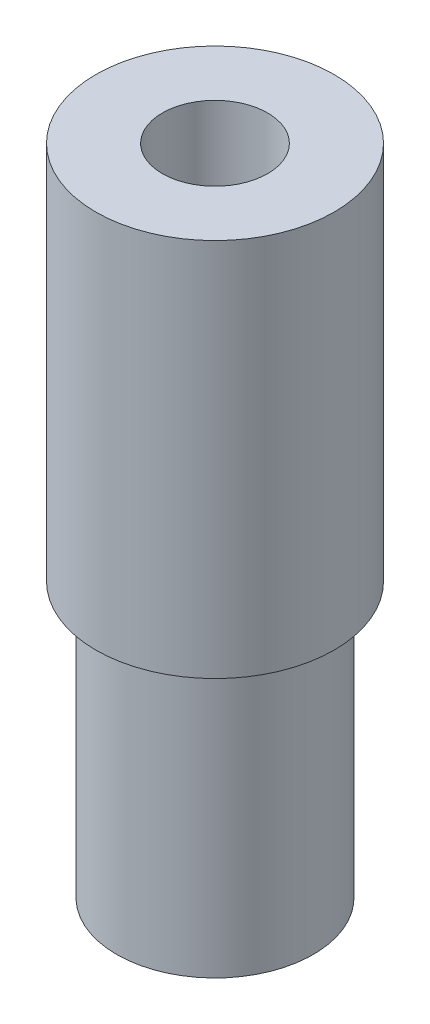
ISO-10303-21;
HEADER;
FILE_DESCRIPTION(('STEP AP214'),'2;1');
FILE_NAME('part.step','',(''),(''),'','','');
FILE_SCHEMA(('AUTOMOTIVE_DESIGN { 1 0 10303 214 1 1 1 1 }'));
ENDSEC;
DATA;
#1=APPLICATION_CONTEXT('core data for automotive mechanical design processes');
#2=APPLICATION_PROTOCOL_DEFINITION('international standard','automotive_design',2000,#1);
#3=PRODUCT_CONTEXT('',#1,'mechanical');
#4=PRODUCT('Part','Part','',(#3));
#5=PRODUCT_RELATED_PRODUCT_CATEGORY('part','',(#4));
#6=PRODUCT_DEFINITION_FORMATION('','',#4);
#7=PRODUCT_DEFINITION_CONTEXT('part definition',#1,'design');
#8=PRODUCT_DEFINITION('design','',#6,#7);
#9=PRODUCT_DEFINITION_SHAPE('','',#8);
#10=(LENGTH_UNIT() NAMED_UNIT(*) SI_UNIT(.MILLI.,.METRE.));
#11=(NAMED_UNIT(*) PLANE_ANGLE_UNIT() SI_UNIT($,.RADIAN.));
#12=(NAMED_UNIT(*) SI_UNIT($,.STERADIAN.) SOLID_ANGLE_UNIT());
#13=UNCERTAINTY_MEASURE_WITH_UNIT(LENGTH_MEASURE(1.E-05),#10,'distance_accuracy_value','');
#14=(GEOMETRIC_REPRESENTATION_CONTEXT(3) GLOBAL_UNCERTAINTY_ASSIGNED_CONTEXT((#13)) GLOBAL_UNIT_ASSIGNED_CONTEXT((#10,
#11,#12)) REPRESENTATION_CONTEXT('',''));
#15=CARTESIAN_POINT('',(0.,0.,0.));
#16=DIRECTION('',(0.,0.,1.));
#17=DIRECTION('',(1.,0.,0.));
#18=AXIS2_PLACEMENT_3D('',#15,#16,#17);
#19=CARTESIAN_POINT('',(0.,13.8,0.));
#20=DIRECTION('',(0.,-1.,0.));
#21=DIRECTION('',(0.,0.,-1.));
#22=AXIS2_PLACEMENT_3D('',#19,#20,#21);
#23=CYLINDRICAL_SURFACE('',#22,4.95);
#24=CARTESIAN_POINT('',(0.,13.8,0.));
#25=DIRECTION('',(0.,1.,0.));
#26=DIRECTION('',(0.,0.,1.));
#27=AXIS2_PLACEMENT_3D('',#24,#25,#26);
#28=CIRCLE('',#27,4.95);
#29=CARTESIAN_POINT('',(0.,13.8,4.95));
#30=VERTEX_POINT('',#29);
#31=EDGE_CURVE('E44',#30,#30,#28,.T.);
#32=ORIENTED_EDGE('',*,*,#31,.F.);
#33=EDGE_LOOP('',(#32));
#34=FACE_BOUND('',#33,.T.);
#35=CARTESIAN_POINT('',(0.,0.,0.));
#36=DIRECTION('',(0.,1.,0.));
#37=DIRECTION('',(0.,0.,1.));
#38=AXIS2_PLACEMENT_3D('',#35,#36,#37);
#39=CIRCLE('',#38,4.95);
#40=CARTESIAN_POINT('',(0.,0.,4.95));
#41=VERTEX_POINT('',#40);
#42=EDGE_CURVE('E48',#41,#41,#39,.T.);
#43=ORIENTED_EDGE('',*,*,#42,.T.);
#44=EDGE_LOOP('',(#43));
#45=FACE_BOUND('',#44,.T.);
#46=ADVANCED_FACE('F33',(#34,#45),#23,.T.);
#47=CARTESIAN_POINT('',(0.,0.,0.));
#48=DIRECTION('',(0.,1.,0.));
#49=DIRECTION('',(0.,0.,1.));
#50=AXIS2_PLACEMENT_3D('',#47,#48,#49);
#51=PLANE('',#50);
#52=CARTESIAN_POINT('',(0.,0.,0.));
#53=DIRECTION('',(0.,1.,0.));
#54=DIRECTION('',(0.,0.,1.));
#55=AXIS2_PLACEMENT_3D('',#52,#53,#54);
#56=CIRCLE('',#55,3.05);
#57=CARTESIAN_POINT('',(0.,0.,3.05));
#58=VERTEX_POINT('',#57);
#59=EDGE_CURVE('E40',#58,#58,#56,.T.);
#60=ORIENTED_EDGE('',*,*,#59,.T.);
#61=EDGE_LOOP('',(#60));
#62=FACE_BOUND('',#61,.T.);
#63=ORIENTED_EDGE('',*,*,#42,.F.);
#64=EDGE_LOOP('',(#63));
#65=FACE_BOUND('',#64,.T.);
#66=ADVANCED_FACE('F75',(#62,#65),#51,.F.);
#67=CARTESIAN_POINT('',(0.,32.9,0.));
#68=DIRECTION('',(0.,-1.,0.));
#69=DIRECTION('',(0.,0.,-1.));
#70=AXIS2_PLACEMENT_3D('',#67,#68,#69);
#71=CYLINDRICAL_SURFACE('',#70,6.);
#72=CARTESIAN_POINT('',(0.,32.9,0.));
#73=DIRECTION('',(0.,1.,0.));
#74=DIRECTION('',(0.,0.,1.));
#75=AXIS2_PLACEMENT_3D('',#72,#73,#74);
#76=CIRCLE('',#75,6.);
#77=CARTESIAN_POINT('',(0.,32.9,6.));
#78=VERTEX_POINT('',#77);
#79=EDGE_CURVE('E52',#78,#78,#76,.T.);
#80=ORIENTED_EDGE('',*,*,#79,.F.);
#81=EDGE_LOOP('',(#80));
#82=FACE_BOUND('',#81,.T.);
#83=CARTESIAN_POINT('',(0.,13.8,0.));
#84=DIRECTION('',(0.,1.,0.));
#85=DIRECTION('',(0.,0.,1.));
#86=AXIS2_PLACEMENT_3D('',#83,#84,#85);
#87=CIRCLE('',#86,6.);
#88=CARTESIAN_POINT('',(0.,13.8,6.));
#89=VERTEX_POINT('',#88);
#90=EDGE_CURVE('E54',#89,#89,#87,.T.);
#91=ORIENTED_EDGE('',*,*,#90,.T.);
#92=EDGE_LOOP('',(#91));
#93=FACE_BOUND('',#92,.T.);
#94=ADVANCED_FACE('F69',(#82,#93),#71,.T.);
#95=CARTESIAN_POINT('',(0.,32.9,0.));
#96=DIRECTION('',(0.,1.,0.));
#97=DIRECTION('',(0.,0.,1.));
#98=AXIS2_PLACEMENT_3D('',#95,#96,#97);
#99=PLANE('',#98);
#100=CARTESIAN_POINT('',(0.,32.9,0.));
#101=DIRECTION('',(0.,1.,0.));
#102=DIRECTION('',(0.,0.,1.));
#103=AXIS2_PLACEMENT_3D('',#100,#101,#102);
#104=CIRCLE('',#103,2.65);
#105=CARTESIAN_POINT('',(0.,32.9,2.65));
#106=VERTEX_POINT('',#105);
#107=EDGE_CURVE('E57',#106,#106,#104,.T.);
#108=ORIENTED_EDGE('',*,*,#107,.F.);
#109=EDGE_LOOP('',(#108));
#110=FACE_BOUND('',#109,.T.);
#111=ORIENTED_EDGE('',*,*,#79,.T.);
#112=EDGE_LOOP('',(#111));
#113=FACE_BOUND('',#112,.T.);
#114=ADVANCED_FACE('F65',(#110,#113),#99,.T.);
#115=CARTESIAN_POINT('',(0.,13.8,0.));
#116=DIRECTION('',(0.,1.,0.));
#117=DIRECTION('',(0.,0.,1.));
#118=AXIS2_PLACEMENT_3D('',#115,#116,#117);
#119=PLANE('',#118);
#120=ORIENTED_EDGE('',*,*,#31,.T.);
#121=EDGE_LOOP('',(#120));
#122=FACE_BOUND('',#121,.T.);
#123=ORIENTED_EDGE('',*,*,#90,.F.);
#124=EDGE_LOOP('',(#123));
#125=FACE_BOUND('',#124,.T.);
#126=ADVANCED_FACE('F68',(#122,#125),#119,.F.);
#127=CARTESIAN_POINT('',(0.,32.9,0.));
#128=DIRECTION('',(0.,-1.,0.));
#129=DIRECTION('',(0.,0.,-1.));
#130=AXIS2_PLACEMENT_3D('',#127,#128,#129);
#131=CYLINDRICAL_SURFACE('',#130,2.65);
#132=CARTESIAN_POINT('',(0.,0.400000000000005,0.));
#133=DIRECTION('',(0.,1.,0.));
#134=DIRECTION('',(0.,0.,1.));
#135=AXIS2_PLACEMENT_3D('',#132,#133,#134);
#136=CIRCLE('',#135,2.65);
#137=CARTESIAN_POINT('',(0.,0.400000000000005,2.65));
#138=VERTEX_POINT('',#137);
#139=EDGE_CURVE('E10',#138,#138,#136,.F.);
#140=ORIENTED_EDGE('',*,*,#139,.T.);
#141=EDGE_LOOP('',(#140));
#142=FACE_BOUND('',#141,.T.);
#143=ORIENTED_EDGE('',*,*,#107,.T.);
#144=EDGE_LOOP('',(#143));
#145=FACE_BOUND('',#144,.T.);
#146=ADVANCED_FACE('F63',(#142,#145),#131,.F.);
#147=CARTESIAN_POINT('',(0.,0.,0.));
#148=DIRECTION('',(0.,-1.,0.));
#149=DIRECTION('',(0.,0.,-1.));
#150=AXIS2_PLACEMENT_3D('',#147,#148,#149);
#151=CONICAL_SURFACE('',#150,3.05,0.785398163397448);
#152=ORIENTED_EDGE('',*,*,#139,.F.);
#153=EDGE_LOOP('',(#152));
#154=FACE_BOUND('',#153,.T.);
#155=ORIENTED_EDGE('',*,*,#59,.F.);
#156=EDGE_LOOP('',(#155));
#157=FACE_BOUND('',#156,.T.);
#158=ADVANCED_FACE('F35',(#154,#157),#151,.F.);
#159=CLOSED_SHELL('',(#46,#66,#94,#114,#126,#146,#158));
#160=MANIFOLD_SOLID_BREP('B2',#159);
#161=ADVANCED_BREP_SHAPE_REPRESENTATION('',(#18,#160),#14);
#162=SHAPE_DEFINITION_REPRESENTATION(#9,#161);
ENDSEC;
END-ISO-10303-21;
